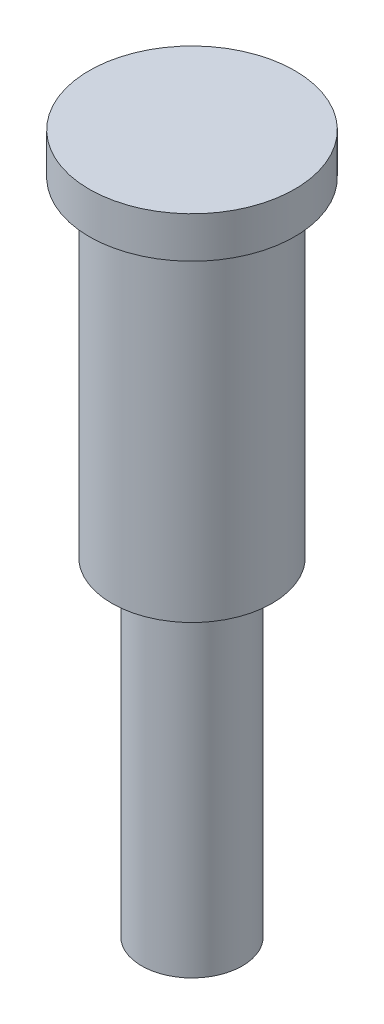
ISO-10303-21;
HEADER;
FILE_DESCRIPTION(('STEP AP214'),'2;1');
FILE_NAME('part.step','',(''),(''),'','','');
FILE_SCHEMA(('AUTOMOTIVE_DESIGN { 1 0 10303 214 1 1 1 1 }'));
ENDSEC;
DATA;
#1=APPLICATION_CONTEXT('core data for automotive mechanical design processes');
#2=APPLICATION_PROTOCOL_DEFINITION('international standard','automotive_design',2000,#1);
#3=PRODUCT_CONTEXT('',#1,'mechanical');
#4=PRODUCT('Part','Part','',(#3));
#5=PRODUCT_RELATED_PRODUCT_CATEGORY('part','',(#4));
#6=PRODUCT_DEFINITION_FORMATION('','',#4);
#7=PRODUCT_DEFINITION_CONTEXT('part definition',#1,'design');
#8=PRODUCT_DEFINITION('design','',#6,#7);
#9=PRODUCT_DEFINITION_SHAPE('','',#8);
#10=(LENGTH_UNIT() NAMED_UNIT(*) SI_UNIT(.MILLI.,.METRE.));
#11=(NAMED_UNIT(*) PLANE_ANGLE_UNIT() SI_UNIT($,.RADIAN.));
#12=(NAMED_UNIT(*) SI_UNIT($,.STERADIAN.) SOLID_ANGLE_UNIT());
#13=UNCERTAINTY_MEASURE_WITH_UNIT(LENGTH_MEASURE(1.E-05),#10,'distance_accuracy_value','');
#14=(GEOMETRIC_REPRESENTATION_CONTEXT(3) GLOBAL_UNCERTAINTY_ASSIGNED_CONTEXT((#13)) GLOBAL_UNIT_ASSIGNED_CONTEXT((#10,
#11,#12)) REPRESENTATION_CONTEXT('',''));
#15=CARTESIAN_POINT('',(0.,0.,0.));
#16=DIRECTION('',(0.,0.,1.));
#17=DIRECTION('',(1.,0.,0.));
#18=AXIS2_PLACEMENT_3D('',#15,#16,#17);
#19=CARTESIAN_POINT('',(0.,2.,0.));
#20=DIRECTION('',(0.,-1.,0.));
#21=DIRECTION('',(0.,0.,-1.));
#22=AXIS2_PLACEMENT_3D('',#19,#20,#21);
#23=CYLINDRICAL_SURFACE('',#22,5.);
#24=CARTESIAN_POINT('',(0.,2.,0.));
#25=DIRECTION('',(0.,1.,0.));
#26=DIRECTION('',(0.,0.,1.));
#27=AXIS2_PLACEMENT_3D('',#24,#25,#26);
#28=CIRCLE('',#27,5.);
#29=CARTESIAN_POINT('',(0.,2.,5.));
#30=VERTEX_POINT('',#29);
#31=EDGE_CURVE('E49',#30,#30,#28,.T.);
#32=ORIENTED_EDGE('',*,*,#31,.F.);
#33=EDGE_LOOP('',(#32));
#34=FACE_BOUND('',#33,.T.);
#35=CARTESIAN_POINT('',(0.,0.,0.));
#36=DIRECTION('',(0.,1.,0.));
#37=DIRECTION('',(0.,0.,1.));
#38=AXIS2_PLACEMENT_3D('',#35,#36,#37);
#39=CIRCLE('',#38,5.);
#40=CARTESIAN_POINT('',(0.,0.,5.));
#41=VERTEX_POINT('',#40);
#42=EDGE_CURVE('E55',#41,#41,#39,.T.);
#43=ORIENTED_EDGE('',*,*,#42,.T.);
#44=EDGE_LOOP('',(#43));
#45=FACE_BOUND('',#44,.T.);
#46=ADVANCED_FACE('F37',(#34,#45),#23,.T.);
#47=CARTESIAN_POINT('',(0.,2.,0.));
#48=DIRECTION('',(0.,1.,0.));
#49=DIRECTION('',(0.,0.,1.));
#50=AXIS2_PLACEMENT_3D('',#47,#48,#49);
#51=PLANE('',#50);
#52=ORIENTED_EDGE('',*,*,#31,.T.);
#53=EDGE_LOOP('',(#52));
#54=FACE_BOUND('',#53,.T.);
#55=ADVANCED_FACE('F102',(#54),#51,.T.);
#56=CARTESIAN_POINT('',(0.,0.,0.));
#57=DIRECTION('',(0.,1.,0.));
#58=DIRECTION('',(0.,0.,1.));
#59=AXIS2_PLACEMENT_3D('',#56,#57,#58);
#60=PLANE('',#59);
#61=CARTESIAN_POINT('',(0.,0.,0.));
#62=DIRECTION('',(0.,-1.,0.));
#63=DIRECTION('',(0.,0.,-1.));
#64=AXIS2_PLACEMENT_3D('',#61,#62,#63);
#65=CIRCLE('',#64,3.9);
#66=CARTESIAN_POINT('',(0.,0.,-3.9));
#67=VERTEX_POINT('',#66);
#68=EDGE_CURVE('E44',#67,#67,#65,.T.);
#69=ORIENTED_EDGE('',*,*,#68,.F.);
#70=EDGE_LOOP('',(#69));
#71=FACE_BOUND('',#70,.T.);
#72=ORIENTED_EDGE('',*,*,#42,.F.);
#73=EDGE_LOOP('',(#72));
#74=FACE_BOUND('',#73,.T.);
#75=ADVANCED_FACE('F107',(#71,#74),#60,.F.);
#76=CARTESIAN_POINT('',(0.,-16.,0.));
#77=DIRECTION('',(0.,1.,0.));
#78=DIRECTION('',(0.,0.,1.));
#79=AXIS2_PLACEMENT_3D('',#76,#77,#78);
#80=CYLINDRICAL_SURFACE('',#79,3.9);
#81=CARTESIAN_POINT('',(0.,-16.,0.));
#82=DIRECTION('',(0.,-1.,0.));
#83=DIRECTION('',(0.,0.,-1.));
#84=AXIS2_PLACEMENT_3D('',#81,#82,#83);
#85=CIRCLE('',#84,3.9);
#86=CARTESIAN_POINT('',(0.,-16.,-3.9));
#87=VERTEX_POINT('',#86);
#88=EDGE_CURVE('E58',#87,#87,#85,.T.);
#89=ORIENTED_EDGE('',*,*,#88,.F.);
#90=EDGE_LOOP('',(#89));
#91=FACE_BOUND('',#90,.T.);
#92=ORIENTED_EDGE('',*,*,#68,.T.);
#93=EDGE_LOOP('',(#92));
#94=FACE_BOUND('',#93,.T.);
#95=ADVANCED_FACE('F96',(#91,#94),#80,.T.);
#96=CARTESIAN_POINT('',(0.,-16.,0.));
#97=DIRECTION('',(0.,-1.,0.));
#98=DIRECTION('',(0.,0.,-1.));
#99=AXIS2_PLACEMENT_3D('',#96,#97,#98);
#100=PLANE('',#99);
#101=CARTESIAN_POINT('',(0.,-16.,0.));
#102=DIRECTION('',(0.,-1.,0.));
#103=DIRECTION('',(0.,0.,-1.));
#104=AXIS2_PLACEMENT_3D('',#101,#102,#103);
#105=CIRCLE('',#104,2.45);
#106=CARTESIAN_POINT('',(0.,-16.,-2.45));
#107=VERTEX_POINT('',#106);
#108=EDGE_CURVE('E71',#107,#107,#105,.T.);
#109=ORIENTED_EDGE('',*,*,#108,.F.);
#110=EDGE_LOOP('',(#109));
#111=FACE_BOUND('',#110,.T.);
#112=ORIENTED_EDGE('',*,*,#88,.T.);
#113=EDGE_LOOP('',(#112));
#114=FACE_BOUND('',#113,.T.);
#115=ADVANCED_FACE('F88',(#111,#114),#100,.T.);
#116=CARTESIAN_POINT('',(0.,-32.,0.));
#117=DIRECTION('',(0.,-1.,0.));
#118=DIRECTION('',(0.,0.,-1.));
#119=AXIS2_PLACEMENT_3D('',#116,#117,#118);
#120=PLANE('',#119);
#121=CARTESIAN_POINT('',(0.,-32.,0.));
#122=DIRECTION('',(0.,-1.,0.));
#123=DIRECTION('',(0.,0.,-1.));
#124=AXIS2_PLACEMENT_3D('',#121,#122,#123);
#125=CIRCLE('',#124,2.45);
#126=CARTESIAN_POINT('',(0.,-32.,-2.45));
#127=VERTEX_POINT('',#126);
#128=EDGE_CURVE('E66',#127,#127,#125,.T.);
#129=ORIENTED_EDGE('',*,*,#128,.T.);
#130=EDGE_LOOP('',(#129));
#131=FACE_BOUND('',#130,.T.);
#132=CARTESIAN_POINT('',(0.,-32.,0.));
#133=DIRECTION('',(0.,-1.,0.));
#134=DIRECTION('',(0.,0.,-1.));
#135=AXIS2_PLACEMENT_3D('',#132,#133,#134);
#136=CIRCLE('',#135,1.6);
#137=CARTESIAN_POINT('',(0.,-32.,-1.6));
#138=VERTEX_POINT('',#137);
#139=EDGE_CURVE('E77',#138,#138,#136,.T.);
#140=ORIENTED_EDGE('',*,*,#139,.F.);
#141=EDGE_LOOP('',(#140));
#142=FACE_BOUND('',#141,.T.);
#143=ADVANCED_FACE('F85',(#131,#142),#120,.T.);
#144=CARTESIAN_POINT('',(0.,-32.,0.));
#145=DIRECTION('',(0.,1.,0.));
#146=DIRECTION('',(0.,0.,1.));
#147=AXIS2_PLACEMENT_3D('',#144,#145,#146);
#148=CYLINDRICAL_SURFACE('',#147,2.45);
#149=ORIENTED_EDGE('',*,*,#128,.F.);
#150=EDGE_LOOP('',(#149));
#151=FACE_BOUND('',#150,.T.);
#152=ORIENTED_EDGE('',*,*,#108,.T.);
#153=EDGE_LOOP('',(#152));
#154=FACE_BOUND('',#153,.T.);
#155=ADVANCED_FACE('F87',(#151,#154),#148,.T.);
#156=CARTESIAN_POINT('',(0.,-32.,0.));
#157=DIRECTION('',(0.,1.,0.));
#158=DIRECTION('',(0.,0.,1.));
#159=AXIS2_PLACEMENT_3D('',#156,#157,#158);
#160=CYLINDRICAL_SURFACE('',#159,1.6);
#161=ORIENTED_EDGE('',*,*,#139,.T.);
#162=EDGE_LOOP('',(#161));
#163=FACE_BOUND('',#162,.T.);
#164=CARTESIAN_POINT('',(0.,-16.,0.));
#165=DIRECTION('',(0.,-1.,0.));
#166=DIRECTION('',(0.,0.,-1.));
#167=AXIS2_PLACEMENT_3D('',#164,#165,#166);
#168=CIRCLE('',#167,1.6);
#169=CARTESIAN_POINT('',(0.,-16.,-1.6));
#170=VERTEX_POINT('',#169);
#171=EDGE_CURVE('E10',#170,#170,#168,.F.);
#172=ORIENTED_EDGE('',*,*,#171,.T.);
#173=EDGE_LOOP('',(#172));
#174=FACE_BOUND('',#173,.T.);
#175=ADVANCED_FACE('F83',(#163,#174),#160,.F.);
#176=ORIENTED_EDGE('',*,*,#171,.F.);
#177=EDGE_LOOP('',(#176));
#178=FACE_BOUND('',#177,.T.);
#179=ADVANCED_FACE('F99',(#178),#100,.T.);
#180=CLOSED_SHELL('',(#46,#55,#75,#95,#115,#143,#155,#175,#179));
#181=MANIFOLD_SOLID_BREP('B2',#180);
#182=ADVANCED_BREP_SHAPE_REPRESENTATION('',(#18,#181),#14);
#183=SHAPE_DEFINITION_REPRESENTATION(#9,#182);
ENDSEC;
END-ISO-10303-21;
